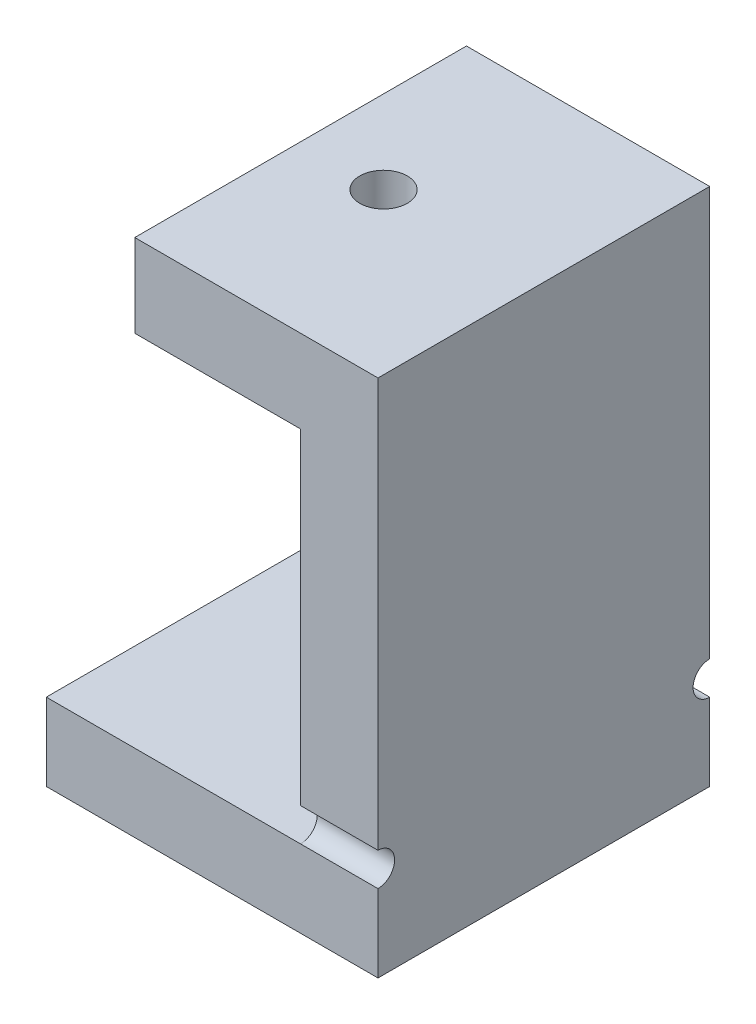
ISO-10303-21;
HEADER;
FILE_DESCRIPTION(('STEP AP214'),'2;1');
FILE_NAME('part.step','',(''),(''),'','','');
FILE_SCHEMA(('AUTOMOTIVE_DESIGN { 1 0 10303 214 1 1 1 1 }'));
ENDSEC;
DATA;
#1=APPLICATION_CONTEXT('core data for automotive mechanical design processes');
#2=APPLICATION_PROTOCOL_DEFINITION('international standard','automotive_design',2000,#1);
#3=PRODUCT_CONTEXT('',#1,'mechanical');
#4=PRODUCT('Part','Part','',(#3));
#5=PRODUCT_RELATED_PRODUCT_CATEGORY('part','',(#4));
#6=PRODUCT_DEFINITION_FORMATION('','',#4);
#7=PRODUCT_DEFINITION_CONTEXT('part definition',#1,'design');
#8=PRODUCT_DEFINITION('design','',#6,#7);
#9=PRODUCT_DEFINITION_SHAPE('','',#8);
#10=(LENGTH_UNIT() NAMED_UNIT(*) SI_UNIT(.MILLI.,.METRE.));
#11=(NAMED_UNIT(*) PLANE_ANGLE_UNIT() SI_UNIT($,.RADIAN.));
#12=(NAMED_UNIT(*) SI_UNIT($,.STERADIAN.) SOLID_ANGLE_UNIT());
#13=UNCERTAINTY_MEASURE_WITH_UNIT(LENGTH_MEASURE(1.E-05),#10,'distance_accuracy_value','');
#14=(GEOMETRIC_REPRESENTATION_CONTEXT(3) GLOBAL_UNCERTAINTY_ASSIGNED_CONTEXT((#13)) GLOBAL_UNIT_ASSIGNED_CONTEXT((#10,
#11,#12)) REPRESENTATION_CONTEXT('',''));
#15=CARTESIAN_POINT('',(0.,0.,0.));
#16=DIRECTION('',(0.,0.,1.));
#17=DIRECTION('',(1.,0.,0.));
#18=AXIS2_PLACEMENT_3D('',#15,#16,#17);
#19=CARTESIAN_POINT('',(-15.,7.,-15.));
#20=DIRECTION('',(0.,0.,1.));
#21=DIRECTION('',(1.,0.,0.));
#22=AXIS2_PLACEMENT_3D('',#19,#20,#21);
#23=PLANE('',#22);
#24=DIRECTION('',(-1.,0.,0.));
#25=VECTOR('',#24,1.);
#26=CARTESIAN_POINT('',(-15.,7.,-15.));
#27=LINE('',#26,#25);
#28=CARTESIAN_POINT('',(8.,7.,-15.));
#29=VERTEX_POINT('',#28);
#30=CARTESIAN_POINT('',(-15.,7.,-15.));
#31=VERTEX_POINT('',#30);
#32=EDGE_CURVE('E163',#29,#31,#27,.T.);
#33=ORIENTED_EDGE('',*,*,#32,.F.);
#34=DIRECTION('',(1.,0.,0.));
#35=VECTOR('',#34,1.);
#36=CARTESIAN_POINT('',(2.,7.,-15.));
#37=LINE('',#36,#35);
#38=CARTESIAN_POINT('',(15.,7.,-15.));
#39=VERTEX_POINT('',#38);
#40=EDGE_CURVE('E154',#29,#39,#37,.T.);
#41=ORIENTED_EDGE('',*,*,#40,.T.);
#42=DIRECTION('',(0.,-1.,0.));
#43=VECTOR('',#42,1.);
#44=CARTESIAN_POINT('',(15.,7.,-15.));
#45=LINE('',#44,#43);
#46=CARTESIAN_POINT('',(15.,0.,-15.));
#47=VERTEX_POINT('',#46);
#48=EDGE_CURVE('E41',#39,#47,#45,.T.);
#49=ORIENTED_EDGE('',*,*,#48,.T.);
#50=DIRECTION('',(-1.,0.,0.));
#51=VECTOR('',#50,1.);
#52=CARTESIAN_POINT('',(-15.,0.,-15.));
#53=LINE('',#52,#51);
#54=CARTESIAN_POINT('',(-15.,0.,-15.));
#55=VERTEX_POINT('',#54);
#56=EDGE_CURVE('E189',#47,#55,#53,.T.);
#57=ORIENTED_EDGE('',*,*,#56,.T.);
#58=DIRECTION('',(0.,-1.,0.));
#59=VECTOR('',#58,1.);
#60=CARTESIAN_POINT('',(-15.,7.,-15.));
#61=LINE('',#60,#59);
#62=EDGE_CURVE('E168',#31,#55,#61,.T.);
#63=ORIENTED_EDGE('',*,*,#62,.F.);
#64=EDGE_LOOP('',(#33,#41,#49,#57,#63));
#65=FACE_BOUND('',#64,.T.);
#66=ADVANCED_FACE('F32',(#65),#23,.F.);
#67=CARTESIAN_POINT('',(-15.,7.,15.));
#68=DIRECTION('',(0.,0.,-1.));
#69=DIRECTION('',(-1.,0.,0.));
#70=AXIS2_PLACEMENT_3D('',#67,#68,#69);
#71=PLANE('',#70);
#72=DIRECTION('',(0.,-1.,0.));
#73=VECTOR('',#72,1.);
#74=CARTESIAN_POINT('',(8.,47.,15.));
#75=LINE('',#74,#73);
#76=CARTESIAN_POINT('',(8.,39.5,15.));
#77=VERTEX_POINT('',#76);
#78=CARTESIAN_POINT('',(8.,10.,15.));
#79=VERTEX_POINT('',#78);
#80=EDGE_CURVE('E233',#77,#79,#75,.T.);
#81=ORIENTED_EDGE('',*,*,#80,.T.);
#82=DIRECTION('',(1.,0.,0.));
#83=VECTOR('',#82,1.);
#84=CARTESIAN_POINT('',(2.,10.,15.));
#85=LINE('',#84,#83);
#86=CARTESIAN_POINT('',(15.,10.,15.));
#87=VERTEX_POINT('',#86);
#88=EDGE_CURVE('E257',#79,#87,#85,.T.);
#89=ORIENTED_EDGE('',*,*,#88,.T.);
#90=DIRECTION('',(0.,-1.,0.));
#91=VECTOR('',#90,1.);
#92=CARTESIAN_POINT('',(15.,7.,15.));
#93=LINE('',#92,#91);
#94=CARTESIAN_POINT('',(15.,47.,15.));
#95=VERTEX_POINT('',#94);
#96=EDGE_CURVE('E196',#95,#87,#93,.T.);
#97=ORIENTED_EDGE('',*,*,#96,.F.);
#98=DIRECTION('',(1.,0.,0.));
#99=VECTOR('',#98,1.);
#100=CARTESIAN_POINT('',(15.,47.,15.));
#101=LINE('',#100,#99);
#102=CARTESIAN_POINT('',(-7.,47.,15.));
#103=VERTEX_POINT('',#102);
#104=EDGE_CURVE('E235',#103,#95,#101,.T.);
#105=ORIENTED_EDGE('',*,*,#104,.F.);
#106=DIRECTION('',(0.,1.,0.));
#107=VECTOR('',#106,1.);
#108=CARTESIAN_POINT('',(-7.,47.,15.));
#109=LINE('',#108,#107);
#110=CARTESIAN_POINT('',(-7.,39.5,15.));
#111=VERTEX_POINT('',#110);
#112=EDGE_CURVE('E316',#111,#103,#109,.T.);
#113=ORIENTED_EDGE('',*,*,#112,.F.);
#114=DIRECTION('',(1.,0.,0.));
#115=VECTOR('',#114,1.);
#116=CARTESIAN_POINT('',(-7.,39.5,15.));
#117=LINE('',#116,#115);
#118=EDGE_CURVE('E226',#111,#77,#117,.T.);
#119=ORIENTED_EDGE('',*,*,#118,.T.);
#120=EDGE_LOOP('',(#81,#89,#97,#105,#113,#119));
#121=FACE_BOUND('',#120,.T.);
#122=ADVANCED_FACE('F340',(#121),#71,.F.);
#123=CARTESIAN_POINT('',(8.,47.,-15.));
#124=DIRECTION('',(1.,0.,0.));
#125=DIRECTION('',(0.,0.,-1.));
#126=AXIS2_PLACEMENT_3D('',#123,#124,#125);
#127=PLANE('',#126);
#128=DIRECTION('',(0.,-1.,0.));
#129=VECTOR('',#128,1.);
#130=CARTESIAN_POINT('',(8.,47.,-15.));
#131=LINE('',#130,#129);
#132=CARTESIAN_POINT('',(8.,39.5,-15.));
#133=VERTEX_POINT('',#132);
#134=CARTESIAN_POINT('',(8.,10.,-15.));
#135=VERTEX_POINT('',#134);
#136=EDGE_CURVE('E190',#133,#135,#131,.T.);
#137=ORIENTED_EDGE('',*,*,#136,.T.);
#138=CARTESIAN_POINT('',(8.,8.5,-15.));
#139=DIRECTION('',(1.,0.,0.));
#140=DIRECTION('',(0.,0.,-1.));
#141=AXIS2_PLACEMENT_3D('',#138,#139,#140);
#142=CIRCLE('',#141,1.5);
#143=EDGE_CURVE('E49',#135,#29,#142,.T.);
#144=ORIENTED_EDGE('',*,*,#143,.T.);
#145=DIRECTION('',(0.,0.,1.));
#146=VECTOR('',#145,1.);
#147=CARTESIAN_POINT('',(8.,7.,-15.));
#148=LINE('',#147,#146);
#149=CARTESIAN_POINT('',(8.,7.,15.));
#150=VERTEX_POINT('',#149);
#151=EDGE_CURVE('E218',#29,#150,#148,.T.);
#152=ORIENTED_EDGE('',*,*,#151,.T.);
#153=CARTESIAN_POINT('',(8.,8.5,15.));
#154=DIRECTION('',(1.,0.,0.));
#155=DIRECTION('',(0.,0.,-1.));
#156=AXIS2_PLACEMENT_3D('',#153,#154,#155);
#157=CIRCLE('',#156,1.5);
#158=EDGE_CURVE('E263',#150,#79,#157,.T.);
#159=ORIENTED_EDGE('',*,*,#158,.T.);
#160=ORIENTED_EDGE('',*,*,#80,.F.);
#161=DIRECTION('',(0.,0.,1.));
#162=VECTOR('',#161,1.);
#163=CARTESIAN_POINT('',(8.,39.5,15.));
#164=LINE('',#163,#162);
#165=EDGE_CURVE('E241',#133,#77,#164,.T.);
#166=ORIENTED_EDGE('',*,*,#165,.F.);
#167=EDGE_LOOP('',(#137,#144,#152,#159,#160,#166));
#168=FACE_BOUND('',#167,.T.);
#169=ADVANCED_FACE('F239',(#168),#127,.F.);
#170=CARTESIAN_POINT('',(15.,7.,-15.));
#171=DIRECTION('',(-1.,0.,0.));
#172=DIRECTION('',(0.,0.,1.));
#173=AXIS2_PLACEMENT_3D('',#170,#171,#172);
#174=PLANE('',#173);
#175=ORIENTED_EDGE('',*,*,#48,.F.);
#176=CARTESIAN_POINT('',(15.,8.5,-15.));
#177=DIRECTION('',(1.,0.,0.));
#178=DIRECTION('',(0.,0.,1.));
#179=AXIS2_PLACEMENT_3D('',#176,#177,#178);
#180=CIRCLE('',#179,1.5);
#181=CARTESIAN_POINT('',(15.,10.,-15.));
#182=VERTEX_POINT('',#181);
#183=EDGE_CURVE('E151',#182,#39,#180,.T.);
#184=ORIENTED_EDGE('',*,*,#183,.F.);
#185=CARTESIAN_POINT('',(15.,47.,-15.));
#186=VERTEX_POINT('',#185);
#187=EDGE_CURVE('E11',#186,#182,#45,.T.);
#188=ORIENTED_EDGE('',*,*,#187,.F.);
#189=DIRECTION('',(0.,0.,-1.));
#190=VECTOR('',#189,1.);
#191=CARTESIAN_POINT('',(15.,47.,-15.));
#192=LINE('',#191,#190);
#193=EDGE_CURVE('E221',#95,#186,#192,.T.);
#194=ORIENTED_EDGE('',*,*,#193,.F.);
#195=ORIENTED_EDGE('',*,*,#96,.T.);
#196=CARTESIAN_POINT('',(15.,8.5,15.));
#197=DIRECTION('',(1.,0.,0.));
#198=DIRECTION('',(0.,0.,-1.));
#199=AXIS2_PLACEMENT_3D('',#196,#197,#198);
#200=CIRCLE('',#199,1.5);
#201=CARTESIAN_POINT('',(15.,7.,15.));
#202=VERTEX_POINT('',#201);
#203=EDGE_CURVE('E249',#202,#87,#200,.T.);
#204=ORIENTED_EDGE('',*,*,#203,.F.);
#205=CARTESIAN_POINT('',(15.,0.,15.));
#206=VERTEX_POINT('',#205);
#207=EDGE_CURVE('E198',#202,#206,#93,.T.);
#208=ORIENTED_EDGE('',*,*,#207,.T.);
#209=DIRECTION('',(0.,0.,-1.));
#210=VECTOR('',#209,1.);
#211=CARTESIAN_POINT('',(15.,0.,-15.));
#212=LINE('',#211,#210);
#213=EDGE_CURVE('E167',#206,#47,#212,.T.);
#214=ORIENTED_EDGE('',*,*,#213,.T.);
#215=EDGE_LOOP('',(#175,#184,#188,#194,#195,#204,#208,#214));
#216=FACE_BOUND('',#215,.T.);
#217=ADVANCED_FACE('F34',(#216),#174,.F.);
#218=ORIENTED_EDGE('',*,*,#187,.T.);
#219=DIRECTION('',(1.,0.,0.));
#220=VECTOR('',#219,1.);
#221=CARTESIAN_POINT('',(2.,10.,-15.));
#222=LINE('',#221,#220);
#223=EDGE_CURVE('E155',#135,#182,#222,.T.);
#224=ORIENTED_EDGE('',*,*,#223,.F.);
#225=ORIENTED_EDGE('',*,*,#136,.F.);
#226=DIRECTION('',(1.,0.,0.));
#227=VECTOR('',#226,1.);
#228=CARTESIAN_POINT('',(-7.,39.5,-15.));
#229=LINE('',#228,#227);
#230=CARTESIAN_POINT('',(-7.,39.5,-15.));
#231=VERTEX_POINT('',#230);
#232=EDGE_CURVE('E222',#231,#133,#229,.T.);
#233=ORIENTED_EDGE('',*,*,#232,.F.);
#234=DIRECTION('',(0.,-1.,0.));
#235=VECTOR('',#234,1.);
#236=CARTESIAN_POINT('',(-7.,47.,-15.));
#237=LINE('',#236,#235);
#238=CARTESIAN_POINT('',(-7.,47.,-15.));
#239=VERTEX_POINT('',#238);
#240=EDGE_CURVE('E322',#239,#231,#237,.T.);
#241=ORIENTED_EDGE('',*,*,#240,.F.);
#242=DIRECTION('',(-1.,0.,0.));
#243=VECTOR('',#242,1.);
#244=CARTESIAN_POINT('',(15.,47.,-15.));
#245=LINE('',#244,#243);
#246=EDGE_CURVE('E224',#186,#239,#245,.T.);
#247=ORIENTED_EDGE('',*,*,#246,.F.);
#248=EDGE_LOOP('',(#218,#224,#225,#233,#241,#247));
#249=FACE_BOUND('',#248,.T.);
#250=ADVANCED_FACE('F244',(#249),#23,.F.);
#251=CARTESIAN_POINT('',(-15.,7.,-15.));
#252=DIRECTION('',(1.,0.,0.));
#253=DIRECTION('',(0.,0.,-1.));
#254=AXIS2_PLACEMENT_3D('',#251,#252,#253);
#255=PLANE('',#254);
#256=DIRECTION('',(0.,0.,1.));
#257=VECTOR('',#256,1.);
#258=CARTESIAN_POINT('',(-15.,0.,-15.));
#259=LINE('',#258,#257);
#260=CARTESIAN_POINT('',(-15.,0.,15.));
#261=VERTEX_POINT('',#260);
#262=EDGE_CURVE('E192',#55,#261,#259,.T.);
#263=ORIENTED_EDGE('',*,*,#262,.T.);
#264=DIRECTION('',(0.,-1.,0.));
#265=VECTOR('',#264,1.);
#266=CARTESIAN_POINT('',(-15.,7.,15.));
#267=LINE('',#266,#265);
#268=CARTESIAN_POINT('',(-15.,7.,15.));
#269=VERTEX_POINT('',#268);
#270=EDGE_CURVE('E170',#269,#261,#267,.T.);
#271=ORIENTED_EDGE('',*,*,#270,.F.);
#272=DIRECTION('',(0.,0.,1.));
#273=VECTOR('',#272,1.);
#274=CARTESIAN_POINT('',(-15.,7.,-15.));
#275=LINE('',#274,#273);
#276=EDGE_CURVE('E176',#31,#269,#275,.T.);
#277=ORIENTED_EDGE('',*,*,#276,.F.);
#278=ORIENTED_EDGE('',*,*,#62,.T.);
#279=EDGE_LOOP('',(#263,#271,#277,#278));
#280=FACE_BOUND('',#279,.T.);
#281=ADVANCED_FACE('F212',(#280),#255,.F.);
#282=ORIENTED_EDGE('',*,*,#207,.F.);
#283=DIRECTION('',(1.,0.,0.));
#284=VECTOR('',#283,1.);
#285=CARTESIAN_POINT('',(2.,7.,15.));
#286=LINE('',#285,#284);
#287=EDGE_CURVE('E261',#150,#202,#286,.T.);
#288=ORIENTED_EDGE('',*,*,#287,.F.);
#289=DIRECTION('',(1.,0.,0.));
#290=VECTOR('',#289,1.);
#291=CARTESIAN_POINT('',(-15.,7.,15.));
#292=LINE('',#291,#290);
#293=EDGE_CURVE('E178',#269,#150,#292,.T.);
#294=ORIENTED_EDGE('',*,*,#293,.F.);
#295=ORIENTED_EDGE('',*,*,#270,.T.);
#296=DIRECTION('',(1.,0.,0.));
#297=VECTOR('',#296,1.);
#298=CARTESIAN_POINT('',(-15.,0.,15.));
#299=LINE('',#298,#297);
#300=EDGE_CURVE('E177',#261,#206,#299,.T.);
#301=ORIENTED_EDGE('',*,*,#300,.T.);
#302=EDGE_LOOP('',(#282,#288,#294,#295,#301));
#303=FACE_BOUND('',#302,.T.);
#304=ADVANCED_FACE('F205',(#303),#71,.F.);
#305=CARTESIAN_POINT('',(15.,7.,15.));
#306=DIRECTION('',(0.,1.,0.));
#307=DIRECTION('',(0.,0.,1.));
#308=AXIS2_PLACEMENT_3D('',#305,#306,#307);
#309=PLANE('',#308);
#310=ORIENTED_EDGE('',*,*,#151,.F.);
#311=ORIENTED_EDGE('',*,*,#32,.T.);
#312=ORIENTED_EDGE('',*,*,#276,.T.);
#313=ORIENTED_EDGE('',*,*,#293,.T.);
#314=EDGE_LOOP('',(#310,#311,#312,#313));
#315=FACE_BOUND('',#314,.T.);
#316=ADVANCED_FACE('F215',(#315),#309,.T.);
#317=CARTESIAN_POINT('',(15.,0.,15.));
#318=DIRECTION('',(0.,1.,0.));
#319=DIRECTION('',(0.,0.,1.));
#320=AXIS2_PLACEMENT_3D('',#317,#318,#319);
#321=PLANE('',#320);
#322=ORIENTED_EDGE('',*,*,#213,.F.);
#323=ORIENTED_EDGE('',*,*,#300,.F.);
#324=ORIENTED_EDGE('',*,*,#262,.F.);
#325=ORIENTED_EDGE('',*,*,#56,.F.);
#326=EDGE_LOOP('',(#322,#323,#324,#325));
#327=FACE_BOUND('',#326,.T.);
#328=ADVANCED_FACE('F211',(#327),#321,.F.);
#329=CARTESIAN_POINT('',(15.,47.,15.));
#330=DIRECTION('',(0.,-1.,0.));
#331=DIRECTION('',(0.,0.,-1.));
#332=AXIS2_PLACEMENT_3D('',#329,#330,#331);
#333=PLANE('',#332);
#334=CARTESIAN_POINT('',(0.500000000000001,47.,0.));
#335=DIRECTION('',(0.,1.,0.));
#336=DIRECTION('',(0.,0.,1.));
#337=AXIS2_PLACEMENT_3D('',#334,#335,#336);
#338=CIRCLE('',#337,2.14999999999999);
#339=CARTESIAN_POINT('',(0.500000000000001,47.,2.14999999999999));
#340=VERTEX_POINT('',#339);
#341=EDGE_CURVE('E265',#340,#340,#338,.T.);
#342=ORIENTED_EDGE('',*,*,#341,.F.);
#343=EDGE_LOOP('',(#342));
#344=FACE_BOUND('',#343,.T.);
#345=ORIENTED_EDGE('',*,*,#193,.T.);
#346=ORIENTED_EDGE('',*,*,#246,.T.);
#347=DIRECTION('',(0.,0.,-1.));
#348=VECTOR('',#347,1.);
#349=CARTESIAN_POINT('',(-7.,47.,15.));
#350=LINE('',#349,#348);
#351=EDGE_CURVE('E319',#103,#239,#350,.T.);
#352=ORIENTED_EDGE('',*,*,#351,.F.);
#353=ORIENTED_EDGE('',*,*,#104,.T.);
#354=EDGE_LOOP('',(#345,#346,#352,#353));
#355=FACE_BOUND('',#354,.T.);
#356=ADVANCED_FACE('F333',(#344,#355),#333,.F.);
#357=CARTESIAN_POINT('',(-7.,39.5,15.));
#358=DIRECTION('',(0.,1.,0.));
#359=DIRECTION('',(0.,0.,1.));
#360=AXIS2_PLACEMENT_3D('',#357,#358,#359);
#361=PLANE('',#360);
#362=DIRECTION('',(0.866025403784438,0.,0.500000000000001));
#363=VECTOR('',#362,1.);
#364=CARTESIAN_POINT('',(0.500000000000002,39.5,-4.3301270189222));
#365=LINE('',#364,#363);
#366=CARTESIAN_POINT('',(0.500000000000002,39.5,-4.3301270189222));
#367=VERTEX_POINT('',#366);
#368=CARTESIAN_POINT('',(4.25,39.5,-2.1650635094611));
#369=VERTEX_POINT('',#368);
#370=EDGE_CURVE('E291',#367,#369,#365,.T.);
#371=ORIENTED_EDGE('',*,*,#370,.F.);
#372=DIRECTION('',(0.866025403784439,0.,-0.5));
#373=VECTOR('',#372,1.);
#374=CARTESIAN_POINT('',(-3.25,39.5,-2.16506350946111));
#375=LINE('',#374,#373);
#376=CARTESIAN_POINT('',(-3.25,39.5,-2.16506350946111));
#377=VERTEX_POINT('',#376);
#378=EDGE_CURVE('E57',#377,#367,#375,.T.);
#379=ORIENTED_EDGE('',*,*,#378,.F.);
#380=DIRECTION('',(0.,0.,-1.));
#381=VECTOR('',#380,1.);
#382=CARTESIAN_POINT('',(-3.25,39.5,2.16506350946109));
#383=LINE('',#382,#381);
#384=CARTESIAN_POINT('',(-3.25,39.5,2.16506350946109));
#385=VERTEX_POINT('',#384);
#386=EDGE_CURVE('E274',#385,#377,#383,.T.);
#387=ORIENTED_EDGE('',*,*,#386,.F.);
#388=DIRECTION('',(-0.866025403784438,0.,-0.5));
#389=VECTOR('',#388,1.);
#390=CARTESIAN_POINT('',(0.499999999999998,39.5,4.33012701892218));
#391=LINE('',#390,#389);
#392=CARTESIAN_POINT('',(0.499999999999998,39.5,4.33012701892218));
#393=VERTEX_POINT('',#392);
#394=EDGE_CURVE('E300',#393,#385,#391,.T.);
#395=ORIENTED_EDGE('',*,*,#394,.F.);
#396=DIRECTION('',(-0.866025403784439,0.,0.5));
#397=VECTOR('',#396,1.);
#398=CARTESIAN_POINT('',(4.25,39.5,2.16506350946109));
#399=LINE('',#398,#397);
#400=CARTESIAN_POINT('',(4.25,39.5,2.16506350946109));
#401=VERTEX_POINT('',#400);
#402=EDGE_CURVE('E297',#401,#393,#399,.T.);
#403=ORIENTED_EDGE('',*,*,#402,.F.);
#404=DIRECTION('',(0.,0.,1.));
#405=VECTOR('',#404,1.);
#406=CARTESIAN_POINT('',(4.25,39.5,-2.1650635094611));
#407=LINE('',#406,#405);
#408=EDGE_CURVE('E294',#369,#401,#407,.T.);
#409=ORIENTED_EDGE('',*,*,#408,.F.);
#410=EDGE_LOOP('',(#371,#379,#387,#395,#403,#409));
#411=FACE_BOUND('',#410,.T.);
#412=ORIENTED_EDGE('',*,*,#165,.T.);
#413=ORIENTED_EDGE('',*,*,#118,.F.);
#414=DIRECTION('',(0.,0.,1.));
#415=VECTOR('',#414,1.);
#416=CARTESIAN_POINT('',(-7.,39.5,15.));
#417=LINE('',#416,#415);
#418=EDGE_CURVE('E324',#231,#111,#417,.T.);
#419=ORIENTED_EDGE('',*,*,#418,.F.);
#420=ORIENTED_EDGE('',*,*,#232,.T.);
#421=EDGE_LOOP('',(#412,#413,#419,#420));
#422=FACE_BOUND('',#421,.T.);
#423=ADVANCED_FACE('F399',(#411,#422),#361,.F.);
#424=CARTESIAN_POINT('',(-7.,39.5,15.));
#425=DIRECTION('',(1.,0.,0.));
#426=DIRECTION('',(0.,0.,-1.));
#427=AXIS2_PLACEMENT_3D('',#424,#425,#426);
#428=PLANE('',#427);
#429=ORIENTED_EDGE('',*,*,#112,.T.);
#430=ORIENTED_EDGE('',*,*,#351,.T.);
#431=ORIENTED_EDGE('',*,*,#240,.T.);
#432=ORIENTED_EDGE('',*,*,#418,.T.);
#433=EDGE_LOOP('',(#429,#430,#431,#432));
#434=FACE_BOUND('',#433,.T.);
#435=ADVANCED_FACE('F338',(#434),#428,.F.);
#436=CARTESIAN_POINT('',(-3.25,42.,-2.16506350946111));
#437=DIRECTION('',(-0.5,0.,-0.866025403784439));
#438=DIRECTION('',(-0.866025403784439,0.,0.5));
#439=AXIS2_PLACEMENT_3D('',#436,#437,#438);
#440=PLANE('',#439);
#441=ORIENTED_EDGE('',*,*,#378,.T.);
#442=DIRECTION('',(0.,-1.,0.));
#443=VECTOR('',#442,1.);
#444=CARTESIAN_POINT('',(0.500000000000002,42.,-4.3301270189222));
#445=LINE('',#444,#443);
#446=CARTESIAN_POINT('',(0.500000000000002,42.,-4.3301270189222));
#447=VERTEX_POINT('',#446);
#448=EDGE_CURVE('E289',#447,#367,#445,.T.);
#449=ORIENTED_EDGE('',*,*,#448,.F.);
#450=DIRECTION('',(0.866025403784439,0.,-0.5));
#451=VECTOR('',#450,1.);
#452=CARTESIAN_POINT('',(-3.25,42.,-2.16506350946111));
#453=LINE('',#452,#451);
#454=CARTESIAN_POINT('',(-3.25,42.,-2.16506350946111));
#455=VERTEX_POINT('',#454);
#456=EDGE_CURVE('E270',#455,#447,#453,.T.);
#457=ORIENTED_EDGE('',*,*,#456,.F.);
#458=DIRECTION('',(0.,-1.,0.));
#459=VECTOR('',#458,1.);
#460=CARTESIAN_POINT('',(-3.25,42.,-2.16506350946111));
#461=LINE('',#460,#459);
#462=EDGE_CURVE('E305',#455,#377,#461,.T.);
#463=ORIENTED_EDGE('',*,*,#462,.T.);
#464=EDGE_LOOP('',(#441,#449,#457,#463));
#465=FACE_BOUND('',#464,.T.);
#466=ADVANCED_FACE('F414',(#465),#440,.F.);
#467=CARTESIAN_POINT('',(-3.25,42.,2.16506350946109));
#468=DIRECTION('',(-1.,0.,0.));
#469=DIRECTION('',(0.,0.,1.));
#470=AXIS2_PLACEMENT_3D('',#467,#468,#469);
#471=PLANE('',#470);
#472=ORIENTED_EDGE('',*,*,#386,.T.);
#473=ORIENTED_EDGE('',*,*,#462,.F.);
#474=DIRECTION('',(0.,0.,-1.));
#475=VECTOR('',#474,1.);
#476=CARTESIAN_POINT('',(-3.25,42.,2.16506350946109));
#477=LINE('',#476,#475);
#478=CARTESIAN_POINT('',(-3.25,42.,2.16506350946109));
#479=VERTEX_POINT('',#478);
#480=EDGE_CURVE('E286',#479,#455,#477,.T.);
#481=ORIENTED_EDGE('',*,*,#480,.F.);
#482=DIRECTION('',(0.,-1.,0.));
#483=VECTOR('',#482,1.);
#484=CARTESIAN_POINT('',(-3.25,42.,2.16506350946109));
#485=LINE('',#484,#483);
#486=EDGE_CURVE('E307',#479,#385,#485,.T.);
#487=ORIENTED_EDGE('',*,*,#486,.T.);
#488=EDGE_LOOP('',(#472,#473,#481,#487));
#489=FACE_BOUND('',#488,.T.);
#490=ADVANCED_FACE('F420',(#489),#471,.F.);
#491=CARTESIAN_POINT('',(0.499999999999998,42.,4.33012701892218));
#492=DIRECTION('',(-0.5,0.,0.866025403784439));
#493=DIRECTION('',(0.866025403784439,0.,0.5));
#494=AXIS2_PLACEMENT_3D('',#491,#492,#493);
#495=PLANE('',#494);
#496=ORIENTED_EDGE('',*,*,#394,.T.);
#497=ORIENTED_EDGE('',*,*,#486,.F.);
#498=DIRECTION('',(-0.866025403784438,0.,-0.5));
#499=VECTOR('',#498,1.);
#500=CARTESIAN_POINT('',(0.499999999999998,42.,4.33012701892218));
#501=LINE('',#500,#499);
#502=CARTESIAN_POINT('',(0.499999999999998,42.,4.33012701892218));
#503=VERTEX_POINT('',#502);
#504=EDGE_CURVE('E283',#503,#479,#501,.T.);
#505=ORIENTED_EDGE('',*,*,#504,.F.);
#506=DIRECTION('',(0.,-1.,0.));
#507=VECTOR('',#506,1.);
#508=CARTESIAN_POINT('',(0.499999999999998,42.,4.33012701892218));
#509=LINE('',#508,#507);
#510=EDGE_CURVE('E309',#503,#393,#509,.T.);
#511=ORIENTED_EDGE('',*,*,#510,.T.);
#512=EDGE_LOOP('',(#496,#497,#505,#511));
#513=FACE_BOUND('',#512,.T.);
#514=ADVANCED_FACE('F427',(#513),#495,.F.);
#515=CARTESIAN_POINT('',(4.25,42.,2.16506350946109));
#516=DIRECTION('',(0.5,0.,0.866025403784439));
#517=DIRECTION('',(0.866025403784439,0.,-0.5));
#518=AXIS2_PLACEMENT_3D('',#515,#516,#517);
#519=PLANE('',#518);
#520=ORIENTED_EDGE('',*,*,#402,.T.);
#521=ORIENTED_EDGE('',*,*,#510,.F.);
#522=DIRECTION('',(-0.866025403784439,0.,0.5));
#523=VECTOR('',#522,1.);
#524=CARTESIAN_POINT('',(4.25,42.,2.16506350946109));
#525=LINE('',#524,#523);
#526=CARTESIAN_POINT('',(4.25,42.,2.16506350946109));
#527=VERTEX_POINT('',#526);
#528=EDGE_CURVE('E280',#527,#503,#525,.T.);
#529=ORIENTED_EDGE('',*,*,#528,.F.);
#530=DIRECTION('',(0.,-1.,0.));
#531=VECTOR('',#530,1.);
#532=CARTESIAN_POINT('',(4.25,42.,2.16506350946109));
#533=LINE('',#532,#531);
#534=EDGE_CURVE('E311',#527,#401,#533,.T.);
#535=ORIENTED_EDGE('',*,*,#534,.T.);
#536=EDGE_LOOP('',(#520,#521,#529,#535));
#537=FACE_BOUND('',#536,.T.);
#538=ADVANCED_FACE('F435',(#537),#519,.F.);
#539=CARTESIAN_POINT('',(4.25,42.,-2.1650635094611));
#540=DIRECTION('',(1.,0.,0.));
#541=DIRECTION('',(0.,0.,-1.));
#542=AXIS2_PLACEMENT_3D('',#539,#540,#541);
#543=PLANE('',#542);
#544=ORIENTED_EDGE('',*,*,#408,.T.);
#545=ORIENTED_EDGE('',*,*,#534,.F.);
#546=DIRECTION('',(0.,0.,1.));
#547=VECTOR('',#546,1.);
#548=CARTESIAN_POINT('',(4.25,42.,-2.1650635094611));
#549=LINE('',#548,#547);
#550=CARTESIAN_POINT('',(4.25,42.,-2.1650635094611));
#551=VERTEX_POINT('',#550);
#552=EDGE_CURVE('E277',#551,#527,#549,.T.);
#553=ORIENTED_EDGE('',*,*,#552,.F.);
#554=DIRECTION('',(0.,-1.,0.));
#555=VECTOR('',#554,1.);
#556=CARTESIAN_POINT('',(4.25,42.,-2.1650635094611));
#557=LINE('',#556,#555);
#558=EDGE_CURVE('E313',#551,#369,#557,.T.);
#559=ORIENTED_EDGE('',*,*,#558,.T.);
#560=EDGE_LOOP('',(#544,#545,#553,#559));
#561=FACE_BOUND('',#560,.T.);
#562=ADVANCED_FACE('F443',(#561),#543,.F.);
#563=CARTESIAN_POINT('',(0.500000000000002,42.,-4.3301270189222));
#564=DIRECTION('',(0.500000000000001,0.,-0.866025403784438));
#565=DIRECTION('',(-0.866025403784438,0.,-0.500000000000001));
#566=AXIS2_PLACEMENT_3D('',#563,#564,#565);
#567=PLANE('',#566);
#568=ORIENTED_EDGE('',*,*,#370,.T.);
#569=ORIENTED_EDGE('',*,*,#558,.F.);
#570=DIRECTION('',(0.866025403784438,0.,0.500000000000001));
#571=VECTOR('',#570,1.);
#572=CARTESIAN_POINT('',(0.500000000000002,42.,-4.3301270189222));
#573=LINE('',#572,#571);
#574=EDGE_CURVE('E273',#447,#551,#573,.T.);
#575=ORIENTED_EDGE('',*,*,#574,.F.);
#576=ORIENTED_EDGE('',*,*,#448,.T.);
#577=EDGE_LOOP('',(#568,#569,#575,#576));
#578=FACE_BOUND('',#577,.T.);
#579=ADVANCED_FACE('F451',(#578),#567,.F.);
#580=CARTESIAN_POINT('',(0.500000000000002,42.,-4.3301270189222));
#581=DIRECTION('',(0.,-1.,0.));
#582=DIRECTION('',(0.,0.,-1.));
#583=AXIS2_PLACEMENT_3D('',#580,#581,#582);
#584=PLANE('',#583);
#585=CARTESIAN_POINT('',(0.500000000000001,42.,0.));
#586=DIRECTION('',(0.,-1.,0.));
#587=DIRECTION('',(0.,0.,-1.));
#588=AXIS2_PLACEMENT_3D('',#585,#586,#587);
#589=CIRCLE('',#588,2.14999999999999);
#590=CARTESIAN_POINT('',(0.500000000000001,42.,-2.14999999999999));
#591=VERTEX_POINT('',#590);
#592=EDGE_CURVE('E36',#591,#591,#589,.T.);
#593=ORIENTED_EDGE('',*,*,#592,.F.);
#594=EDGE_LOOP('',(#593));
#595=FACE_BOUND('',#594,.T.);
#596=ORIENTED_EDGE('',*,*,#456,.T.);
#597=ORIENTED_EDGE('',*,*,#574,.T.);
#598=ORIENTED_EDGE('',*,*,#552,.T.);
#599=ORIENTED_EDGE('',*,*,#528,.T.);
#600=ORIENTED_EDGE('',*,*,#504,.T.);
#601=ORIENTED_EDGE('',*,*,#480,.T.);
#602=EDGE_LOOP('',(#596,#597,#598,#599,#600,#601));
#603=FACE_BOUND('',#602,.T.);
#604=ADVANCED_FACE('F353',(#595,#603),#584,.T.);
#605=CARTESIAN_POINT('',(0.500000000000001,47.,0.));
#606=DIRECTION('',(0.,1.,0.));
#607=DIRECTION('',(0.,0.,1.));
#608=AXIS2_PLACEMENT_3D('',#605,#606,#607);
#609=CYLINDRICAL_SURFACE('',#608,2.14999999999999);
#610=ORIENTED_EDGE('',*,*,#592,.T.);
#611=EDGE_LOOP('',(#610));
#612=FACE_BOUND('',#611,.T.);
#613=ORIENTED_EDGE('',*,*,#341,.T.);
#614=EDGE_LOOP('',(#613));
#615=FACE_BOUND('',#614,.T.);
#616=ADVANCED_FACE('F346',(#612,#615),#609,.F.);
#617=CARTESIAN_POINT('',(2.,8.5,15.));
#618=DIRECTION('',(1.,0.,0.));
#619=DIRECTION('',(0.,0.,-1.));
#620=AXIS2_PLACEMENT_3D('',#617,#618,#619);
#621=CYLINDRICAL_SURFACE('',#620,1.5);
#622=ORIENTED_EDGE('',*,*,#287,.T.);
#623=ORIENTED_EDGE('',*,*,#203,.T.);
#624=ORIENTED_EDGE('',*,*,#88,.F.);
#625=ORIENTED_EDGE('',*,*,#158,.F.);
#626=EDGE_LOOP('',(#622,#623,#624,#625));
#627=FACE_BOUND('',#626,.T.);
#628=ADVANCED_FACE('F344',(#627),#621,.F.);
#629=CARTESIAN_POINT('',(2.,8.5,-15.));
#630=DIRECTION('',(1.,0.,0.));
#631=DIRECTION('',(0.,0.,-1.));
#632=AXIS2_PLACEMENT_3D('',#629,#630,#631);
#633=CYLINDRICAL_SURFACE('',#632,1.5);
#634=ORIENTED_EDGE('',*,*,#223,.T.);
#635=ORIENTED_EDGE('',*,*,#183,.T.);
#636=ORIENTED_EDGE('',*,*,#40,.F.);
#637=ORIENTED_EDGE('',*,*,#143,.F.);
#638=EDGE_LOOP('',(#634,#635,#636,#637));
#639=FACE_BOUND('',#638,.T.);
#640=ADVANCED_FACE('F153',(#639),#633,.F.);
#641=CLOSED_SHELL('',(#66,#122,#169,#217,#250,#281,#304,#316,#328,#356,#423,#435,#466,#490,#514,
#538,#562,#579,#604,#616,#628,#640));
#642=MANIFOLD_SOLID_BREP('B2',#641);
#643=ADVANCED_BREP_SHAPE_REPRESENTATION('',(#18,#642),#14);
#644=SHAPE_DEFINITION_REPRESENTATION(#9,#643);
ENDSEC;
END-ISO-10303-21;
